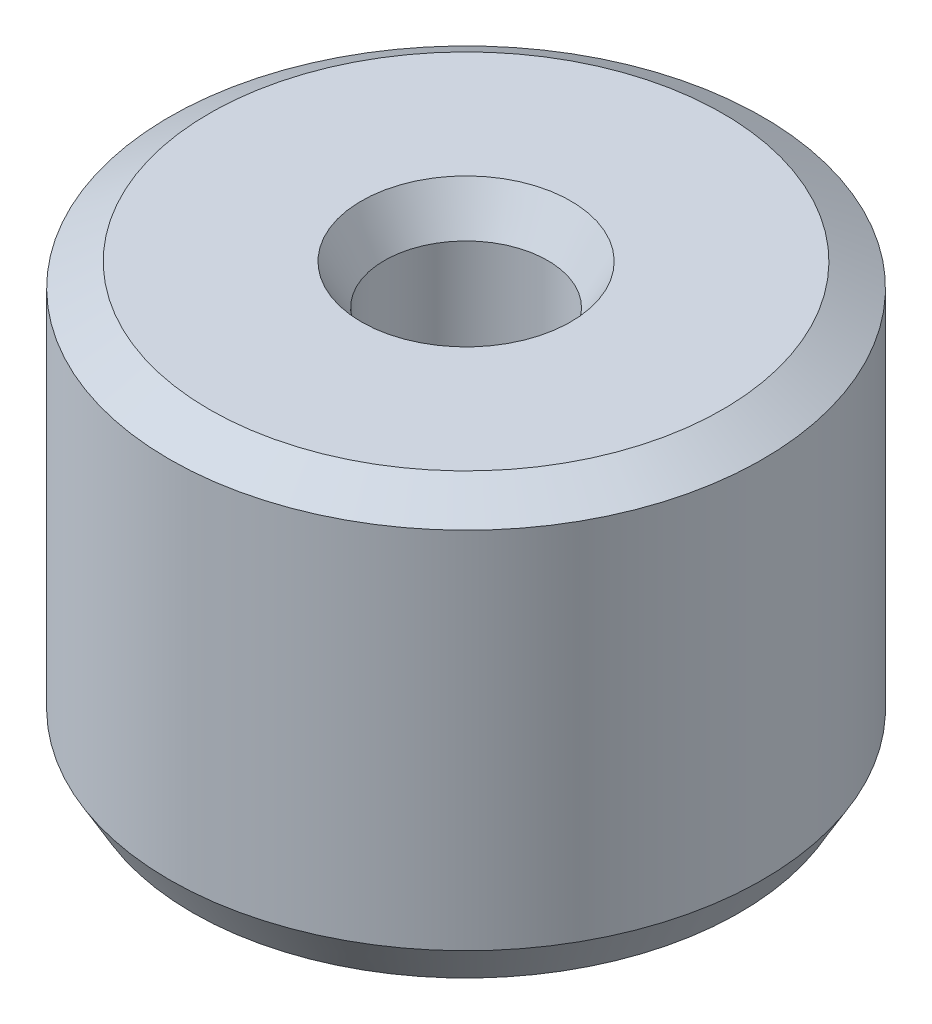
ISO-10303-21;
HEADER;
FILE_DESCRIPTION(('STEP AP214'),'2;1');
FILE_NAME('part.step','',(''),(''),'','','');
FILE_SCHEMA(('AUTOMOTIVE_DESIGN { 1 0 10303 214 1 1 1 1 }'));
ENDSEC;
DATA;
#1=APPLICATION_CONTEXT('core data for automotive mechanical design processes');
#2=APPLICATION_PROTOCOL_DEFINITION('international standard','automotive_design',2000,#1);
#3=PRODUCT_CONTEXT('',#1,'mechanical');
#4=PRODUCT('Part','Part','',(#3));
#5=PRODUCT_RELATED_PRODUCT_CATEGORY('part','',(#4));
#6=PRODUCT_DEFINITION_FORMATION('','',#4);
#7=PRODUCT_DEFINITION_CONTEXT('part definition',#1,'design');
#8=PRODUCT_DEFINITION('design','',#6,#7);
#9=PRODUCT_DEFINITION_SHAPE('','',#8);
#10=(LENGTH_UNIT() NAMED_UNIT(*) SI_UNIT(.MILLI.,.METRE.));
#11=(NAMED_UNIT(*) PLANE_ANGLE_UNIT() SI_UNIT($,.RADIAN.));
#12=(NAMED_UNIT(*) SI_UNIT($,.STERADIAN.) SOLID_ANGLE_UNIT());
#13=UNCERTAINTY_MEASURE_WITH_UNIT(LENGTH_MEASURE(1.E-05),#10,'distance_accuracy_value','');
#14=(GEOMETRIC_REPRESENTATION_CONTEXT(3) GLOBAL_UNCERTAINTY_ASSIGNED_CONTEXT((#13)) GLOBAL_UNIT_ASSIGNED_CONTEXT((#10,
#11,#12)) REPRESENTATION_CONTEXT('',''));
#15=CARTESIAN_POINT('',(0.,0.,0.));
#16=DIRECTION('',(0.,0.,1.));
#17=DIRECTION('',(1.,0.,0.));
#18=AXIS2_PLACEMENT_3D('',#15,#16,#17);
#19=CARTESIAN_POINT('',(0.,7.20281469317084,0.));
#20=DIRECTION('',(0.,-1.,0.));
#21=DIRECTION('',(0.,0.,-1.));
#22=AXIS2_PLACEMENT_3D('',#19,#20,#21);
#23=CYLINDRICAL_SURFACE('',#22,5.);
#24=CARTESIAN_POINT('',(0.,0.674249719291444,0.));
#25=DIRECTION('',(0.,1.,0.));
#26=DIRECTION('',(0.,0.,1.));
#27=AXIS2_PLACEMENT_3D('',#24,#25,#26);
#28=CIRCLE('',#27,5.);
#29=CARTESIAN_POINT('',(0.,0.674249719291444,5.));
#30=VERTEX_POINT('',#29);
#31=EDGE_CURVE('E10',#30,#30,#28,.T.);
#32=ORIENTED_EDGE('',*,*,#31,.T.);
#33=EDGE_LOOP('',(#32));
#34=FACE_BOUND('',#33,.T.);
#35=CARTESIAN_POINT('',(0.,6.81353643623689,0.));
#36=DIRECTION('',(0.,1.,0.));
#37=DIRECTION('',(0.,0.,1.));
#38=AXIS2_PLACEMENT_3D('',#35,#36,#37);
#39=CIRCLE('',#38,5.);
#40=CARTESIAN_POINT('',(0.,6.81353643623689,5.));
#41=VERTEX_POINT('',#40);
#42=EDGE_CURVE('E50',#41,#41,#39,.F.);
#43=ORIENTED_EDGE('',*,*,#42,.T.);
#44=EDGE_LOOP('',(#43));
#45=FACE_BOUND('',#44,.T.);
#46=ADVANCED_FACE('F39',(#34,#45),#23,.T.);
#47=CARTESIAN_POINT('',(0.,7.20281469317084,0.));
#48=DIRECTION('',(0.,1.,0.));
#49=DIRECTION('',(0.,0.,1.));
#50=AXIS2_PLACEMENT_3D('',#47,#48,#49);
#51=PLANE('',#50);
#52=CARTESIAN_POINT('',(0.,7.20281469317084,0.));
#53=DIRECTION('',(0.,1.,0.));
#54=DIRECTION('',(0.,0.,1.));
#55=AXIS2_PLACEMENT_3D('',#52,#53,#54);
#56=CIRCLE('',#55,1.76594528728605);
#57=CARTESIAN_POINT('',(0.,7.20281469317084,1.76594528728605));
#58=VERTEX_POINT('',#57);
#59=EDGE_CURVE('E58',#58,#58,#56,.F.);
#60=ORIENTED_EDGE('',*,*,#59,.T.);
#61=EDGE_LOOP('',(#60));
#62=FACE_BOUND('',#61,.T.);
#63=CARTESIAN_POINT('',(0.,7.20281469317084,0.));
#64=DIRECTION('',(0.,1.,0.));
#65=DIRECTION('',(0.,0.,1.));
#66=AXIS2_PLACEMENT_3D('',#63,#64,#65);
#67=CIRCLE('',#66,4.32575028070855);
#68=CARTESIAN_POINT('',(0.,7.20281469317084,4.32575028070855));
#69=VERTEX_POINT('',#68);
#70=EDGE_CURVE('E61',#69,#69,#67,.T.);
#71=ORIENTED_EDGE('',*,*,#70,.T.);
#72=EDGE_LOOP('',(#71));
#73=FACE_BOUND('',#72,.T.);
#74=ADVANCED_FACE('F88',(#62,#73),#51,.T.);
#75=CARTESIAN_POINT('',(0.,0.,0.));
#76=DIRECTION('',(0.,1.,0.));
#77=DIRECTION('',(0.,0.,1.));
#78=AXIS2_PLACEMENT_3D('',#75,#76,#77);
#79=PLANE('',#78);
#80=CARTESIAN_POINT('',(0.,0.,0.));
#81=DIRECTION('',(0.,1.,0.));
#82=DIRECTION('',(0.,0.,1.));
#83=AXIS2_PLACEMENT_3D('',#80,#81,#82);
#84=CIRCLE('',#83,2.05091674964354);
#85=CARTESIAN_POINT('',(0.,0.,2.05091674964354));
#86=VERTEX_POINT('',#85);
#87=EDGE_CURVE('E51',#86,#86,#84,.T.);
#88=ORIENTED_EDGE('',*,*,#87,.T.);
#89=EDGE_LOOP('',(#88));
#90=FACE_BOUND('',#89,.T.);
#91=CARTESIAN_POINT('',(0.,0.,0.));
#92=DIRECTION('',(0.,1.,0.));
#93=DIRECTION('',(0.,0.,1.));
#94=AXIS2_PLACEMENT_3D('',#91,#92,#93);
#95=CIRCLE('',#94,4.61072174306605);
#96=CARTESIAN_POINT('',(0.,0.,4.61072174306605));
#97=VERTEX_POINT('',#96);
#98=EDGE_CURVE('E54',#97,#97,#95,.F.);
#99=ORIENTED_EDGE('',*,*,#98,.T.);
#100=EDGE_LOOP('',(#99));
#101=FACE_BOUND('',#100,.T.);
#102=ADVANCED_FACE('F83',(#90,#101),#79,.F.);
#103=CARTESIAN_POINT('',(0.,7.20281469317084,0.));
#104=DIRECTION('',(0.,-1.,0.));
#105=DIRECTION('',(0.,0.,-1.));
#106=AXIS2_PLACEMENT_3D('',#103,#104,#105);
#107=CYLINDRICAL_SURFACE('',#106,1.37666703035209);
#108=CARTESIAN_POINT('',(0.,6.52856497387939,0.));
#109=DIRECTION('',(0.,1.,0.));
#110=DIRECTION('',(0.,0.,1.));
#111=AXIS2_PLACEMENT_3D('',#108,#109,#110);
#112=CIRCLE('',#111,1.37666703035209);
#113=CARTESIAN_POINT('',(0.,6.52856497387939,1.37666703035209));
#114=VERTEX_POINT('',#113);
#115=EDGE_CURVE('E67',#114,#114,#112,.T.);
#116=ORIENTED_EDGE('',*,*,#115,.T.);
#117=EDGE_LOOP('',(#116));
#118=FACE_BOUND('',#117,.T.);
#119=CARTESIAN_POINT('',(0.,0.38927825693395,0.));
#120=DIRECTION('',(0.,1.,0.));
#121=DIRECTION('',(0.,0.,1.));
#122=AXIS2_PLACEMENT_3D('',#119,#120,#121);
#123=CIRCLE('',#122,1.37666703035209);
#124=CARTESIAN_POINT('',(0.,0.38927825693395,1.37666703035209));
#125=VERTEX_POINT('',#124);
#126=EDGE_CURVE('E69',#125,#125,#123,.F.);
#127=ORIENTED_EDGE('',*,*,#126,.T.);
#128=EDGE_LOOP('',(#127));
#129=FACE_BOUND('',#128,.T.);
#130=ADVANCED_FACE('F71',(#118,#129),#107,.F.);
#131=CARTESIAN_POINT('',(0.,6.52856497387939,0.));
#132=DIRECTION('',(0.,1.,0.));
#133=DIRECTION('',(0.,0.,1.));
#134=AXIS2_PLACEMENT_3D('',#131,#132,#133);
#135=CONICAL_SURFACE('',#134,1.37666703035209,0.523598775598303);
#136=ORIENTED_EDGE('',*,*,#59,.F.);
#137=EDGE_LOOP('',(#136));
#138=FACE_BOUND('',#137,.T.);
#139=ORIENTED_EDGE('',*,*,#115,.F.);
#140=EDGE_LOOP('',(#139));
#141=FACE_BOUND('',#140,.T.);
#142=ADVANCED_FACE('F77',(#138,#141),#135,.F.);
#143=CARTESIAN_POINT('',(0.,0.,0.));
#144=DIRECTION('',(0.,-1.,0.));
#145=DIRECTION('',(0.,0.,-1.));
#146=AXIS2_PLACEMENT_3D('',#143,#144,#145);
#147=CONICAL_SURFACE('',#146,2.05091674964354,1.04719755119659);
#148=ORIENTED_EDGE('',*,*,#126,.F.);
#149=EDGE_LOOP('',(#148));
#150=FACE_BOUND('',#149,.T.);
#151=ORIENTED_EDGE('',*,*,#87,.F.);
#152=EDGE_LOOP('',(#151));
#153=FACE_BOUND('',#152,.T.);
#154=ADVANCED_FACE('F73',(#150,#153),#147,.F.);
#155=CARTESIAN_POINT('',(0.,0.674249719291444,0.));
#156=DIRECTION('',(0.,1.,0.));
#157=DIRECTION('',(0.,0.,1.));
#158=AXIS2_PLACEMENT_3D('',#155,#156,#157);
#159=CONICAL_SURFACE('',#158,5.,0.523598775598304);
#160=ORIENTED_EDGE('',*,*,#98,.F.);
#161=EDGE_LOOP('',(#160));
#162=FACE_BOUND('',#161,.T.);
#163=ORIENTED_EDGE('',*,*,#31,.F.);
#164=EDGE_LOOP('',(#163));
#165=FACE_BOUND('',#164,.T.);
#166=ADVANCED_FACE('F76',(#162,#165),#159,.T.);
#167=CARTESIAN_POINT('',(0.,7.20281469317084,0.));
#168=DIRECTION('',(0.,-1.,0.));
#169=DIRECTION('',(0.,0.,-1.));
#170=AXIS2_PLACEMENT_3D('',#167,#168,#169);
#171=CONICAL_SURFACE('',#170,4.32575028070855,1.0471975511966);
#172=ORIENTED_EDGE('',*,*,#42,.F.);
#173=EDGE_LOOP('',(#172));
#174=FACE_BOUND('',#173,.T.);
#175=ORIENTED_EDGE('',*,*,#70,.F.);
#176=EDGE_LOOP('',(#175));
#177=FACE_BOUND('',#176,.T.);
#178=ADVANCED_FACE('F45',(#174,#177),#171,.T.);
#179=CLOSED_SHELL('',(#46,#74,#102,#130,#142,#154,#166,#178));
#180=MANIFOLD_SOLID_BREP('B2',#179);
#181=ADVANCED_BREP_SHAPE_REPRESENTATION('',(#18,#180),#14);
#182=SHAPE_DEFINITION_REPRESENTATION(#9,#181);
ENDSEC;
END-ISO-10303-21;
